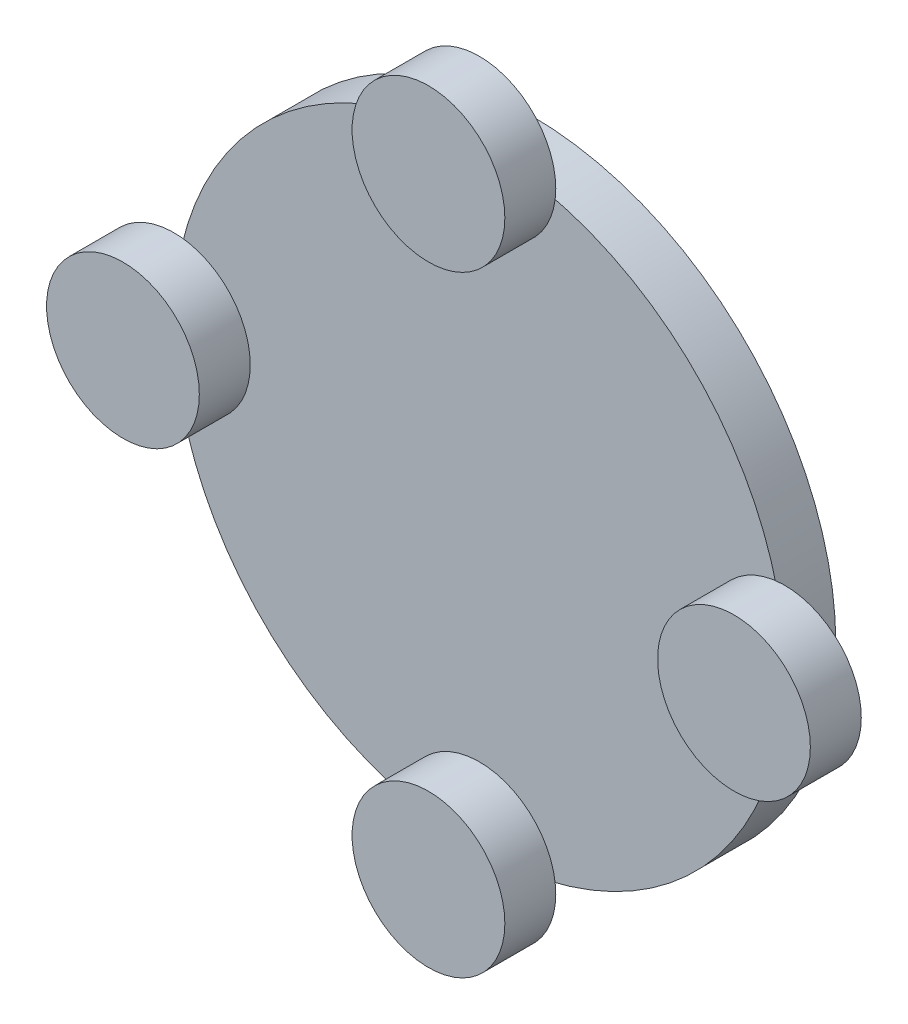
ISO-10303-21;
HEADER;
FILE_DESCRIPTION(('STEP AP214'),'2;1');
FILE_NAME('part.step','',(''),(''),'','','');
FILE_SCHEMA(('AUTOMOTIVE_DESIGN { 1 0 10303 214 1 1 1 1 }'));
ENDSEC;
DATA;
#1=APPLICATION_CONTEXT('core data for automotive mechanical design processes');
#2=APPLICATION_PROTOCOL_DEFINITION('international standard','automotive_design',2000,#1);
#3=PRODUCT_CONTEXT('',#1,'mechanical');
#4=PRODUCT('Part','Part','',(#3));
#5=PRODUCT_RELATED_PRODUCT_CATEGORY('part','',(#4));
#6=PRODUCT_DEFINITION_FORMATION('','',#4);
#7=PRODUCT_DEFINITION_CONTEXT('part definition',#1,'design');
#8=PRODUCT_DEFINITION('design','',#6,#7);
#9=PRODUCT_DEFINITION_SHAPE('','',#8);
#10=(LENGTH_UNIT() NAMED_UNIT(*) SI_UNIT(.MILLI.,.METRE.));
#11=(NAMED_UNIT(*) PLANE_ANGLE_UNIT() SI_UNIT($,.RADIAN.));
#12=(NAMED_UNIT(*) SI_UNIT($,.STERADIAN.) SOLID_ANGLE_UNIT());
#13=UNCERTAINTY_MEASURE_WITH_UNIT(LENGTH_MEASURE(1.E-05),#10,'distance_accuracy_value','');
#14=(GEOMETRIC_REPRESENTATION_CONTEXT(3) GLOBAL_UNCERTAINTY_ASSIGNED_CONTEXT((#13)) GLOBAL_UNIT_ASSIGNED_CONTEXT((#10,
#11,#12)) REPRESENTATION_CONTEXT('',''));
#15=CARTESIAN_POINT('',(0.,0.,0.));
#16=DIRECTION('',(0.,0.,1.));
#17=DIRECTION('',(1.,0.,0.));
#18=AXIS2_PLACEMENT_3D('',#15,#16,#17);
#19=CARTESIAN_POINT('',(30.,0.,5.));
#20=DIRECTION('',(0.,0.,-1.));
#21=DIRECTION('',(-1.,0.,0.));
#22=AXIS2_PLACEMENT_3D('',#19,#20,#21);
#23=CYLINDRICAL_SURFACE('',#22,7.5);
#24=CARTESIAN_POINT('',(30.,0.,5.));
#25=DIRECTION('',(0.,0.,1.));
#26=DIRECTION('',(1.,0.,0.));
#27=AXIS2_PLACEMENT_3D('',#24,#25,#26);
#28=CIRCLE('',#27,7.5);
#29=CARTESIAN_POINT('',(37.5,0.,5.));
#30=VERTEX_POINT('',#29);
#31=EDGE_CURVE('E44',#30,#30,#28,.T.);
#32=ORIENTED_EDGE('',*,*,#31,.F.);
#33=EDGE_LOOP('',(#32));
#34=FACE_BOUND('',#33,.T.);
#35=CARTESIAN_POINT('',(30.,0.,0.));
#36=DIRECTION('',(0.,0.,1.));
#37=DIRECTION('',(1.,0.,0.));
#38=AXIS2_PLACEMENT_3D('',#35,#36,#37);
#39=CIRCLE('',#38,7.5);
#40=CARTESIAN_POINT('',(37.5,0.,0.));
#41=VERTEX_POINT('',#40);
#42=EDGE_CURVE('E11',#41,#41,#39,.T.);
#43=ORIENTED_EDGE('',*,*,#42,.T.);
#44=EDGE_LOOP('',(#43));
#45=FACE_BOUND('',#44,.T.);
#46=ADVANCED_FACE('F40',(#34,#45),#23,.T.);
#47=CARTESIAN_POINT('',(30.,0.,5.));
#48=DIRECTION('',(0.,0.,1.));
#49=DIRECTION('',(1.,0.,0.));
#50=AXIS2_PLACEMENT_3D('',#47,#48,#49);
#51=PLANE('',#50);
#52=ORIENTED_EDGE('',*,*,#31,.T.);
#53=EDGE_LOOP('',(#52));
#54=FACE_BOUND('',#53,.T.);
#55=ADVANCED_FACE('F42',(#54),#51,.T.);
#56=CARTESIAN_POINT('',(30.,0.,0.));
#57=DIRECTION('',(0.,0.,1.));
#58=DIRECTION('',(1.,0.,0.));
#59=AXIS2_PLACEMENT_3D('',#56,#57,#58);
#60=PLANE('',#59);
#61=ORIENTED_EDGE('',*,*,#42,.F.);
#62=EDGE_LOOP('',(#61));
#63=FACE_BOUND('',#62,.T.);
#64=ADVANCED_FACE('F59',(#63),#60,.F.);
#65=CLOSED_SHELL('',(#46,#55,#64));
#66=MANIFOLD_SOLID_BREP('B2',#65);
#67=CARTESIAN_POINT('',(0.,-30.,5.));
#68=DIRECTION('',(0.,0.,-1.));
#69=DIRECTION('',(-1.,0.,0.));
#70=AXIS2_PLACEMENT_3D('',#67,#68,#69);
#71=CYLINDRICAL_SURFACE('',#70,7.5);
#72=CARTESIAN_POINT('',(0.,-30.,5.));
#73=DIRECTION('',(0.,0.,1.));
#74=DIRECTION('',(1.,0.,0.));
#75=AXIS2_PLACEMENT_3D('',#72,#73,#74);
#76=CIRCLE('',#75,7.5);
#77=CARTESIAN_POINT('',(7.5,-30.,5.));
#78=VERTEX_POINT('',#77);
#79=EDGE_CURVE('E93',#78,#78,#76,.T.);
#80=ORIENTED_EDGE('',*,*,#79,.F.);
#81=EDGE_LOOP('',(#80));
#82=FACE_BOUND('',#81,.T.);
#83=CARTESIAN_POINT('',(0.,-30.,0.));
#84=DIRECTION('',(0.,0.,1.));
#85=DIRECTION('',(1.,0.,0.));
#86=AXIS2_PLACEMENT_3D('',#83,#84,#85);
#87=CIRCLE('',#86,7.5);
#88=CARTESIAN_POINT('',(7.5,-30.,0.));
#89=VERTEX_POINT('',#88);
#90=EDGE_CURVE('E39',#89,#89,#87,.T.);
#91=ORIENTED_EDGE('',*,*,#90,.T.);
#92=EDGE_LOOP('',(#91));
#93=FACE_BOUND('',#92,.T.);
#94=ADVANCED_FACE('F89',(#82,#93),#71,.T.);
#95=CARTESIAN_POINT('',(0.,-30.,5.));
#96=DIRECTION('',(0.,0.,1.));
#97=DIRECTION('',(1.,0.,0.));
#98=AXIS2_PLACEMENT_3D('',#95,#96,#97);
#99=PLANE('',#98);
#100=ORIENTED_EDGE('',*,*,#79,.T.);
#101=EDGE_LOOP('',(#100));
#102=FACE_BOUND('',#101,.T.);
#103=ADVANCED_FACE('F91',(#102),#99,.T.);
#104=CARTESIAN_POINT('',(0.,-30.,0.));
#105=DIRECTION('',(0.,0.,1.));
#106=DIRECTION('',(1.,0.,0.));
#107=AXIS2_PLACEMENT_3D('',#104,#105,#106);
#108=PLANE('',#107);
#109=ORIENTED_EDGE('',*,*,#90,.F.);
#110=EDGE_LOOP('',(#109));
#111=FACE_BOUND('',#110,.T.);
#112=ADVANCED_FACE('F108',(#111),#108,.F.);
#113=CLOSED_SHELL('',(#94,#103,#112));
#114=MANIFOLD_SOLID_BREP('B6',#113);
#115=CARTESIAN_POINT('',(-30.,0.,5.));
#116=DIRECTION('',(0.,0.,-1.));
#117=DIRECTION('',(-1.,0.,0.));
#118=AXIS2_PLACEMENT_3D('',#115,#116,#117);
#119=CYLINDRICAL_SURFACE('',#118,7.5);
#120=CARTESIAN_POINT('',(-30.,0.,5.));
#121=DIRECTION('',(0.,0.,1.));
#122=DIRECTION('',(1.,0.,0.));
#123=AXIS2_PLACEMENT_3D('',#120,#121,#122);
#124=CIRCLE('',#123,7.5);
#125=CARTESIAN_POINT('',(-22.5,0.,5.));
#126=VERTEX_POINT('',#125);
#127=EDGE_CURVE('E142',#126,#126,#124,.T.);
#128=ORIENTED_EDGE('',*,*,#127,.F.);
#129=EDGE_LOOP('',(#128));
#130=FACE_BOUND('',#129,.T.);
#131=CARTESIAN_POINT('',(-30.,0.,0.));
#132=DIRECTION('',(0.,0.,1.));
#133=DIRECTION('',(1.,0.,0.));
#134=AXIS2_PLACEMENT_3D('',#131,#132,#133);
#135=CIRCLE('',#134,7.5);
#136=CARTESIAN_POINT('',(-22.5,0.,0.));
#137=VERTEX_POINT('',#136);
#138=EDGE_CURVE('E88',#137,#137,#135,.T.);
#139=ORIENTED_EDGE('',*,*,#138,.T.);
#140=EDGE_LOOP('',(#139));
#141=FACE_BOUND('',#140,.T.);
#142=ADVANCED_FACE('F138',(#130,#141),#119,.T.);
#143=CARTESIAN_POINT('',(-30.,0.,5.));
#144=DIRECTION('',(0.,0.,1.));
#145=DIRECTION('',(1.,0.,0.));
#146=AXIS2_PLACEMENT_3D('',#143,#144,#145);
#147=PLANE('',#146);
#148=ORIENTED_EDGE('',*,*,#127,.T.);
#149=EDGE_LOOP('',(#148));
#150=FACE_BOUND('',#149,.T.);
#151=ADVANCED_FACE('F140',(#150),#147,.T.);
#152=CARTESIAN_POINT('',(-30.,0.,0.));
#153=DIRECTION('',(0.,0.,1.));
#154=DIRECTION('',(1.,0.,0.));
#155=AXIS2_PLACEMENT_3D('',#152,#153,#154);
#156=PLANE('',#155);
#157=ORIENTED_EDGE('',*,*,#138,.F.);
#158=EDGE_LOOP('',(#157));
#159=FACE_BOUND('',#158,.T.);
#160=ADVANCED_FACE('F157',(#159),#156,.F.);
#161=CLOSED_SHELL('',(#142,#151,#160));
#162=MANIFOLD_SOLID_BREP('B34',#161);
#163=CARTESIAN_POINT('',(0.,30.,5.));
#164=DIRECTION('',(0.,0.,-1.));
#165=DIRECTION('',(-1.,0.,0.));
#166=AXIS2_PLACEMENT_3D('',#163,#164,#165);
#167=CYLINDRICAL_SURFACE('',#166,7.5);
#168=CARTESIAN_POINT('',(0.,30.,5.));
#169=DIRECTION('',(0.,0.,1.));
#170=DIRECTION('',(1.,0.,0.));
#171=AXIS2_PLACEMENT_3D('',#168,#169,#170);
#172=CIRCLE('',#171,7.5);
#173=CARTESIAN_POINT('',(7.5,30.,5.));
#174=VERTEX_POINT('',#173);
#175=EDGE_CURVE('E137',#174,#174,#172,.T.);
#176=ORIENTED_EDGE('',*,*,#175,.F.);
#177=EDGE_LOOP('',(#176));
#178=FACE_BOUND('',#177,.T.);
#179=CARTESIAN_POINT('',(0.,30.,0.));
#180=DIRECTION('',(0.,0.,1.));
#181=DIRECTION('',(1.,0.,0.));
#182=AXIS2_PLACEMENT_3D('',#179,#180,#181);
#183=CIRCLE('',#182,7.5);
#184=CARTESIAN_POINT('',(7.5,30.,0.));
#185=VERTEX_POINT('',#184);
#186=EDGE_CURVE('E189',#185,#185,#183,.T.);
#187=ORIENTED_EDGE('',*,*,#186,.T.);
#188=EDGE_LOOP('',(#187));
#189=FACE_BOUND('',#188,.T.);
#190=ADVANCED_FACE('F186',(#178,#189),#167,.T.);
#191=CARTESIAN_POINT('',(0.,30.,5.));
#192=DIRECTION('',(0.,0.,1.));
#193=DIRECTION('',(1.,0.,0.));
#194=AXIS2_PLACEMENT_3D('',#191,#192,#193);
#195=PLANE('',#194);
#196=ORIENTED_EDGE('',*,*,#175,.T.);
#197=EDGE_LOOP('',(#196));
#198=FACE_BOUND('',#197,.T.);
#199=ADVANCED_FACE('F201',(#198),#195,.T.);
#200=CARTESIAN_POINT('',(0.,30.,0.));
#201=DIRECTION('',(0.,0.,1.));
#202=DIRECTION('',(1.,0.,0.));
#203=AXIS2_PLACEMENT_3D('',#200,#201,#202);
#204=PLANE('',#203);
#205=ORIENTED_EDGE('',*,*,#186,.F.);
#206=EDGE_LOOP('',(#205));
#207=FACE_BOUND('',#206,.T.);
#208=ADVANCED_FACE('F199',(#207),#204,.F.);
#209=CLOSED_SHELL('',(#190,#199,#208));
#210=MANIFOLD_SOLID_BREP('B83',#209);
#211=CARTESIAN_POINT('',(0.,0.,-5.));
#212=DIRECTION('',(0.,0.,1.));
#213=DIRECTION('',(1.,0.,0.));
#214=AXIS2_PLACEMENT_3D('',#211,#212,#213);
#215=CYLINDRICAL_SURFACE('',#214,30.);
#216=CARTESIAN_POINT('',(0.,0.,-5.));
#217=DIRECTION('',(0.,0.,1.));
#218=DIRECTION('',(1.,0.,0.));
#219=AXIS2_PLACEMENT_3D('',#216,#217,#218);
#220=CIRCLE('',#219,30.);
#221=CARTESIAN_POINT('',(30.,0.,-5.));
#222=VERTEX_POINT('',#221);
#223=EDGE_CURVE('E185',#222,#222,#220,.T.);
#224=ORIENTED_EDGE('',*,*,#223,.T.);
#225=EDGE_LOOP('',(#224));
#226=FACE_BOUND('',#225,.T.);
#227=CARTESIAN_POINT('',(0.,0.,0.));
#228=DIRECTION('',(0.,0.,1.));
#229=DIRECTION('',(1.,0.,0.));
#230=AXIS2_PLACEMENT_3D('',#227,#228,#229);
#231=CIRCLE('',#230,30.);
#232=CARTESIAN_POINT('',(30.,0.,0.));
#233=VERTEX_POINT('',#232);
#234=EDGE_CURVE('E230',#233,#233,#231,.T.);
#235=ORIENTED_EDGE('',*,*,#234,.F.);
#236=EDGE_LOOP('',(#235));
#237=FACE_BOUND('',#236,.T.);
#238=ADVANCED_FACE('F227',(#226,#237),#215,.T.);
#239=CARTESIAN_POINT('',(0.,0.,-5.));
#240=DIRECTION('',(0.,0.,1.));
#241=DIRECTION('',(1.,0.,0.));
#242=AXIS2_PLACEMENT_3D('',#239,#240,#241);
#243=PLANE('',#242);
#244=ORIENTED_EDGE('',*,*,#223,.F.);
#245=EDGE_LOOP('',(#244));
#246=FACE_BOUND('',#245,.T.);
#247=ADVANCED_FACE('F242',(#246),#243,.F.);
#248=CARTESIAN_POINT('',(0.,0.,0.));
#249=DIRECTION('',(0.,0.,1.));
#250=DIRECTION('',(1.,0.,0.));
#251=AXIS2_PLACEMENT_3D('',#248,#249,#250);
#252=PLANE('',#251);
#253=ORIENTED_EDGE('',*,*,#234,.T.);
#254=EDGE_LOOP('',(#253));
#255=FACE_BOUND('',#254,.T.);
#256=ADVANCED_FACE('F239',(#255),#252,.T.);
#257=CLOSED_SHELL('',(#238,#247,#256));
#258=MANIFOLD_SOLID_BREP('B132',#257);
#259=ADVANCED_BREP_SHAPE_REPRESENTATION('',(#18,#66,#114,#162,#210,#258),#14);
#260=SHAPE_DEFINITION_REPRESENTATION(#9,#259);
ENDSEC;
END-ISO-10303-21;
